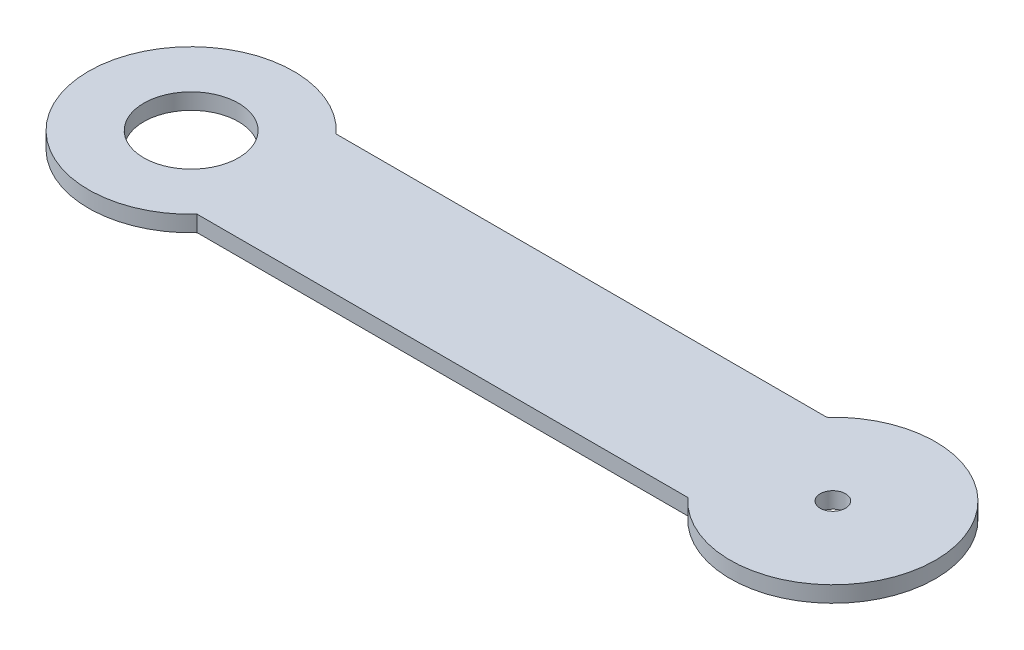
ISO-10303-21;
HEADER;
FILE_DESCRIPTION(('STEP AP214'),'2;1');
FILE_NAME('part.step','',(''),(''),'','','');
FILE_SCHEMA(('AUTOMOTIVE_DESIGN { 1 0 10303 214 1 1 1 1 }'));
ENDSEC;
DATA;
#1=APPLICATION_CONTEXT('core data for automotive mechanical design processes');
#2=APPLICATION_PROTOCOL_DEFINITION('international standard','automotive_design',2000,#1);
#3=PRODUCT_CONTEXT('',#1,'mechanical');
#4=PRODUCT('Part','Part','',(#3));
#5=PRODUCT_RELATED_PRODUCT_CATEGORY('part','',(#4));
#6=PRODUCT_DEFINITION_FORMATION('','',#4);
#7=PRODUCT_DEFINITION_CONTEXT('part definition',#1,'design');
#8=PRODUCT_DEFINITION('design','',#6,#7);
#9=PRODUCT_DEFINITION_SHAPE('','',#8);
#10=(LENGTH_UNIT() NAMED_UNIT(*) SI_UNIT(.MILLI.,.METRE.));
#11=(NAMED_UNIT(*) PLANE_ANGLE_UNIT() SI_UNIT($,.RADIAN.));
#12=(NAMED_UNIT(*) SI_UNIT($,.STERADIAN.) SOLID_ANGLE_UNIT());
#13=UNCERTAINTY_MEASURE_WITH_UNIT(LENGTH_MEASURE(1.E-05),#10,'distance_accuracy_value','');
#14=(GEOMETRIC_REPRESENTATION_CONTEXT(3) GLOBAL_UNCERTAINTY_ASSIGNED_CONTEXT((#13)) GLOBAL_UNIT_ASSIGNED_CONTEXT((#10,
#11,#12)) REPRESENTATION_CONTEXT('',''));
#15=CARTESIAN_POINT('',(0.,0.,0.));
#16=DIRECTION('',(0.,0.,1.));
#17=DIRECTION('',(1.,0.,0.));
#18=AXIS2_PLACEMENT_3D('',#15,#16,#17);
#19=CARTESIAN_POINT('',(-50.8,2.54,0.));
#20=DIRECTION('',(0.,-1.,0.));
#21=DIRECTION('',(0.,0.,-1.));
#22=AXIS2_PLACEMENT_3D('',#19,#20,#21);
#23=CYLINDRICAL_SURFACE('',#22,16.252288298);
#24=CARTESIAN_POINT('',(-50.8,0.,0.));
#25=DIRECTION('',(0.,1.,0.));
#26=DIRECTION('',(0.,0.,1.));
#27=AXIS2_PLACEMENT_3D('',#24,#25,#26);
#28=CIRCLE('',#27,16.252288298);
#29=CARTESIAN_POINT('',(-38.8360175977517,0.,-11.));
#30=VERTEX_POINT('',#29);
#31=CARTESIAN_POINT('',(-38.8360175977517,0.,11.));
#32=VERTEX_POINT('',#31);
#33=EDGE_CURVE('E96',#30,#32,#28,.T.);
#34=ORIENTED_EDGE('',*,*,#33,.T.);
#35=DIRECTION('',(0.,-1.,0.));
#36=VECTOR('',#35,1.);
#37=CARTESIAN_POINT('',(-38.8360175977517,2.54,11.));
#38=LINE('',#37,#36);
#39=CARTESIAN_POINT('',(-38.8360175977517,2.54,11.));
#40=VERTEX_POINT('',#39);
#41=EDGE_CURVE('E11',#40,#32,#38,.T.);
#42=ORIENTED_EDGE('',*,*,#41,.F.);
#43=CARTESIAN_POINT('',(-50.8,2.54,0.));
#44=DIRECTION('',(0.,1.,0.));
#45=DIRECTION('',(0.,0.,1.));
#46=AXIS2_PLACEMENT_3D('',#43,#44,#45);
#47=CIRCLE('',#46,16.252288298);
#48=CARTESIAN_POINT('',(-38.8360175977517,2.54,-11.));
#49=VERTEX_POINT('',#48);
#50=EDGE_CURVE('E84',#49,#40,#47,.T.);
#51=ORIENTED_EDGE('',*,*,#50,.F.);
#52=DIRECTION('',(0.,-1.,0.));
#53=VECTOR('',#52,1.);
#54=CARTESIAN_POINT('',(-38.8360175977517,2.54,-11.));
#55=LINE('',#54,#53);
#56=EDGE_CURVE('E92',#49,#30,#55,.T.);
#57=ORIENTED_EDGE('',*,*,#56,.T.);
#58=EDGE_LOOP('',(#34,#42,#51,#57));
#59=FACE_BOUND('',#58,.T.);
#60=ADVANCED_FACE('F33',(#59),#23,.T.);
#61=CARTESIAN_POINT('',(-38.8360175977517,2.54,11.));
#62=DIRECTION('',(0.,0.,-1.));
#63=DIRECTION('',(-1.,0.,0.));
#64=AXIS2_PLACEMENT_3D('',#61,#62,#63);
#65=PLANE('',#64);
#66=DIRECTION('',(1.,0.,0.));
#67=VECTOR('',#66,1.);
#68=CARTESIAN_POINT('',(-38.8360175977517,0.,11.));
#69=LINE('',#68,#67);
#70=CARTESIAN_POINT('',(38.8360175977517,0.,11.));
#71=VERTEX_POINT('',#70);
#72=EDGE_CURVE('E88',#32,#71,#69,.T.);
#73=ORIENTED_EDGE('',*,*,#72,.T.);
#74=DIRECTION('',(0.,-1.,0.));
#75=VECTOR('',#74,1.);
#76=CARTESIAN_POINT('',(38.8360175977517,2.54,11.));
#77=LINE('',#76,#75);
#78=CARTESIAN_POINT('',(38.8360175977517,2.54,11.));
#79=VERTEX_POINT('',#78);
#80=EDGE_CURVE('E41',#79,#71,#77,.T.);
#81=ORIENTED_EDGE('',*,*,#80,.F.);
#82=DIRECTION('',(1.,0.,0.));
#83=VECTOR('',#82,1.);
#84=CARTESIAN_POINT('',(-38.8360175977517,2.54,11.));
#85=LINE('',#84,#83);
#86=EDGE_CURVE('E79',#40,#79,#85,.T.);
#87=ORIENTED_EDGE('',*,*,#86,.F.);
#88=ORIENTED_EDGE('',*,*,#41,.T.);
#89=EDGE_LOOP('',(#73,#81,#87,#88));
#90=FACE_BOUND('',#89,.T.);
#91=ADVANCED_FACE('F87',(#90),#65,.F.);
#92=CARTESIAN_POINT('',(50.8,2.54,0.));
#93=DIRECTION('',(0.,-1.,0.));
#94=DIRECTION('',(0.,0.,-1.));
#95=AXIS2_PLACEMENT_3D('',#92,#93,#94);
#96=CYLINDRICAL_SURFACE('',#95,16.252288298);
#97=CARTESIAN_POINT('',(50.8,0.,0.));
#98=DIRECTION('',(0.,1.,0.));
#99=DIRECTION('',(0.,0.,1.));
#100=AXIS2_PLACEMENT_3D('',#97,#98,#99);
#101=CIRCLE('',#100,16.252288298);
#102=CARTESIAN_POINT('',(38.8360175977517,0.,-11.));
#103=VERTEX_POINT('',#102);
#104=EDGE_CURVE('E66',#71,#103,#101,.T.);
#105=ORIENTED_EDGE('',*,*,#104,.T.);
#106=DIRECTION('',(0.,-1.,0.));
#107=VECTOR('',#106,1.);
#108=CARTESIAN_POINT('',(38.8360175977517,2.54,-11.));
#109=LINE('',#108,#107);
#110=CARTESIAN_POINT('',(38.8360175977517,2.54,-11.));
#111=VERTEX_POINT('',#110);
#112=EDGE_CURVE('E89',#111,#103,#109,.T.);
#113=ORIENTED_EDGE('',*,*,#112,.F.);
#114=CARTESIAN_POINT('',(50.8,2.54,0.));
#115=DIRECTION('',(0.,1.,0.));
#116=DIRECTION('',(0.,0.,1.));
#117=AXIS2_PLACEMENT_3D('',#114,#115,#116);
#118=CIRCLE('',#117,16.252288298);
#119=EDGE_CURVE('E82',#79,#111,#118,.T.);
#120=ORIENTED_EDGE('',*,*,#119,.F.);
#121=ORIENTED_EDGE('',*,*,#80,.T.);
#122=EDGE_LOOP('',(#105,#113,#120,#121));
#123=FACE_BOUND('',#122,.T.);
#124=ADVANCED_FACE('F90',(#123),#96,.T.);
#125=CARTESIAN_POINT('',(-38.8360175977517,2.54,-11.));
#126=DIRECTION('',(0.,0.,1.));
#127=DIRECTION('',(1.,0.,0.));
#128=AXIS2_PLACEMENT_3D('',#125,#126,#127);
#129=PLANE('',#128);
#130=DIRECTION('',(-1.,0.,0.));
#131=VECTOR('',#130,1.);
#132=CARTESIAN_POINT('',(-38.8360175977517,0.,-11.));
#133=LINE('',#132,#131);
#134=EDGE_CURVE('E72',#103,#30,#133,.T.);
#135=ORIENTED_EDGE('',*,*,#134,.T.);
#136=ORIENTED_EDGE('',*,*,#56,.F.);
#137=DIRECTION('',(-1.,0.,0.));
#138=VECTOR('',#137,1.);
#139=CARTESIAN_POINT('',(-38.8360175977517,2.54,-11.));
#140=LINE('',#139,#138);
#141=EDGE_CURVE('E49',#111,#49,#140,.T.);
#142=ORIENTED_EDGE('',*,*,#141,.F.);
#143=ORIENTED_EDGE('',*,*,#112,.T.);
#144=EDGE_LOOP('',(#135,#136,#142,#143));
#145=FACE_BOUND('',#144,.T.);
#146=ADVANCED_FACE('F104',(#145),#129,.F.);
#147=CARTESIAN_POINT('',(-50.8,2.54,0.));
#148=DIRECTION('',(0.,1.,0.));
#149=DIRECTION('',(0.,0.,1.));
#150=AXIS2_PLACEMENT_3D('',#147,#148,#149);
#151=PLANE('',#150);
#152=CARTESIAN_POINT('',(-50.8,2.54,0.));
#153=DIRECTION('',(0.,1.,0.));
#154=DIRECTION('',(0.,0.,1.));
#155=AXIS2_PLACEMENT_3D('',#152,#153,#154);
#156=CIRCLE('',#155,7.5);
#157=CARTESIAN_POINT('',(-50.8,2.54,7.5));
#158=VERTEX_POINT('',#157);
#159=EDGE_CURVE('E116',#158,#158,#156,.T.);
#160=ORIENTED_EDGE('',*,*,#159,.F.);
#161=EDGE_LOOP('',(#160));
#162=FACE_BOUND('',#161,.T.);
#163=CARTESIAN_POINT('',(50.8,2.54,0.));
#164=DIRECTION('',(0.,1.,0.));
#165=DIRECTION('',(0.,0.,1.));
#166=AXIS2_PLACEMENT_3D('',#163,#164,#165);
#167=CIRCLE('',#166,2.);
#168=CARTESIAN_POINT('',(50.8,2.54,2.));
#169=VERTEX_POINT('',#168);
#170=EDGE_CURVE('E110',#169,#169,#167,.T.);
#171=ORIENTED_EDGE('',*,*,#170,.F.);
#172=EDGE_LOOP('',(#171));
#173=FACE_BOUND('',#172,.T.);
#174=ORIENTED_EDGE('',*,*,#50,.T.);
#175=ORIENTED_EDGE('',*,*,#86,.T.);
#176=ORIENTED_EDGE('',*,*,#119,.T.);
#177=ORIENTED_EDGE('',*,*,#141,.T.);
#178=EDGE_LOOP('',(#174,#175,#176,#177));
#179=FACE_BOUND('',#178,.T.);
#180=ADVANCED_FACE('F80',(#162,#173,#179),#151,.T.);
#181=CARTESIAN_POINT('',(-50.8,0.,0.));
#182=DIRECTION('',(0.,1.,0.));
#183=DIRECTION('',(0.,0.,1.));
#184=AXIS2_PLACEMENT_3D('',#181,#182,#183);
#185=PLANE('',#184);
#186=CARTESIAN_POINT('',(-50.8,0.,0.));
#187=DIRECTION('',(0.,1.,0.));
#188=DIRECTION('',(0.,0.,1.));
#189=AXIS2_PLACEMENT_3D('',#186,#187,#188);
#190=CIRCLE('',#189,7.5);
#191=CARTESIAN_POINT('',(-50.8,0.,7.5));
#192=VERTEX_POINT('',#191);
#193=EDGE_CURVE('E99',#192,#192,#190,.T.);
#194=ORIENTED_EDGE('',*,*,#193,.T.);
#195=EDGE_LOOP('',(#194));
#196=FACE_BOUND('',#195,.T.);
#197=CARTESIAN_POINT('',(50.8,0.,0.));
#198=DIRECTION('',(0.,1.,0.));
#199=DIRECTION('',(0.,0.,1.));
#200=AXIS2_PLACEMENT_3D('',#197,#198,#199);
#201=CIRCLE('',#200,2.);
#202=CARTESIAN_POINT('',(50.8,0.,2.));
#203=VERTEX_POINT('',#202);
#204=EDGE_CURVE('E113',#203,#203,#201,.T.);
#205=ORIENTED_EDGE('',*,*,#204,.T.);
#206=EDGE_LOOP('',(#205));
#207=FACE_BOUND('',#206,.T.);
#208=ORIENTED_EDGE('',*,*,#33,.F.);
#209=ORIENTED_EDGE('',*,*,#134,.F.);
#210=ORIENTED_EDGE('',*,*,#104,.F.);
#211=ORIENTED_EDGE('',*,*,#72,.F.);
#212=EDGE_LOOP('',(#208,#209,#210,#211));
#213=FACE_BOUND('',#212,.T.);
#214=ADVANCED_FACE('F107',(#196,#207,#213),#185,.F.);
#215=CARTESIAN_POINT('',(50.8,0.,0.));
#216=DIRECTION('',(0.,1.,0.));
#217=DIRECTION('',(0.,0.,1.));
#218=AXIS2_PLACEMENT_3D('',#215,#216,#217);
#219=CYLINDRICAL_SURFACE('',#218,2.);
#220=ORIENTED_EDGE('',*,*,#204,.F.);
#221=EDGE_LOOP('',(#220));
#222=FACE_BOUND('',#221,.T.);
#223=ORIENTED_EDGE('',*,*,#170,.T.);
#224=EDGE_LOOP('',(#223));
#225=FACE_BOUND('',#224,.T.);
#226=ADVANCED_FACE('F127',(#222,#225),#219,.F.);
#227=CARTESIAN_POINT('',(-50.8,0.,0.));
#228=DIRECTION('',(0.,1.,0.));
#229=DIRECTION('',(0.,0.,1.));
#230=AXIS2_PLACEMENT_3D('',#227,#228,#229);
#231=CYLINDRICAL_SURFACE('',#230,7.5);
#232=ORIENTED_EDGE('',*,*,#193,.F.);
#233=EDGE_LOOP('',(#232));
#234=FACE_BOUND('',#233,.T.);
#235=ORIENTED_EDGE('',*,*,#159,.T.);
#236=EDGE_LOOP('',(#235));
#237=FACE_BOUND('',#236,.T.);
#238=ADVANCED_FACE('F124',(#234,#237),#231,.F.);
#239=CLOSED_SHELL('',(#60,#91,#124,#146,#180,#214,#226,#238));
#240=MANIFOLD_SOLID_BREP('B2',#239);
#241=ADVANCED_BREP_SHAPE_REPRESENTATION('',(#18,#240),#14);
#242=SHAPE_DEFINITION_REPRESENTATION(#9,#241);
ENDSEC;
END-ISO-10303-21;
